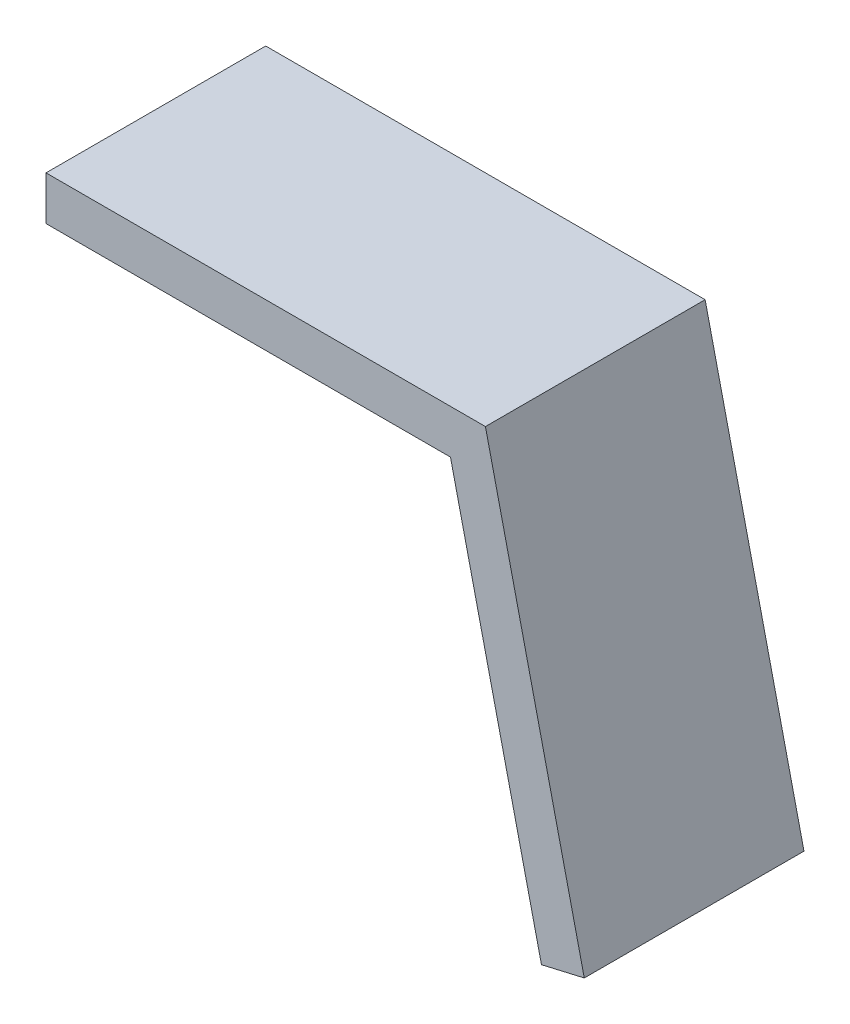
ISO-10303-21;
HEADER;
FILE_DESCRIPTION(('STEP AP214'),'2;1');
FILE_NAME('part.step','',(''),(''),'','','');
FILE_SCHEMA(('AUTOMOTIVE_DESIGN { 1 0 10303 214 1 1 1 1 }'));
ENDSEC;
DATA;
#1=APPLICATION_CONTEXT('core data for automotive mechanical design processes');
#2=APPLICATION_PROTOCOL_DEFINITION('international standard','automotive_design',2000,#1);
#3=PRODUCT_CONTEXT('',#1,'mechanical');
#4=PRODUCT('Part','Part','',(#3));
#5=PRODUCT_RELATED_PRODUCT_CATEGORY('part','',(#4));
#6=PRODUCT_DEFINITION_FORMATION('','',#4);
#7=PRODUCT_DEFINITION_CONTEXT('part definition',#1,'design');
#8=PRODUCT_DEFINITION('design','',#6,#7);
#9=PRODUCT_DEFINITION_SHAPE('','',#8);
#10=(LENGTH_UNIT() NAMED_UNIT(*) SI_UNIT(.MILLI.,.METRE.));
#11=(NAMED_UNIT(*) PLANE_ANGLE_UNIT() SI_UNIT($,.RADIAN.));
#12=(NAMED_UNIT(*) SI_UNIT($,.STERADIAN.) SOLID_ANGLE_UNIT());
#13=UNCERTAINTY_MEASURE_WITH_UNIT(LENGTH_MEASURE(1.E-05),#10,'distance_accuracy_value','');
#14=(GEOMETRIC_REPRESENTATION_CONTEXT(3) GLOBAL_UNCERTAINTY_ASSIGNED_CONTEXT((#13)) GLOBAL_UNIT_ASSIGNED_CONTEXT((#10,
#11,#12)) REPRESENTATION_CONTEXT('',''));
#15=CARTESIAN_POINT('',(0.,0.,0.));
#16=DIRECTION('',(0.,0.,1.));
#17=DIRECTION('',(1.,0.,0.));
#18=AXIS2_PLACEMENT_3D('',#15,#16,#17);
#19=CARTESIAN_POINT('',(100.,0.,50.));
#20=DIRECTION('',(-0.974370064785234,-0.224951054343869,0.));
#21=DIRECTION('',(0.224951054343869,-0.974370064785234,0.));
#22=AXIS2_PLACEMENT_3D('',#19,#20,#21);
#23=PLANE('',#22);
#24=DIRECTION('',(-0.224951054343869,0.974370064785234,0.));
#25=VECTOR('',#24,1.);
#26=CARTESIAN_POINT('',(100.,0.,0.));
#27=LINE('',#26,#25);
#28=CARTESIAN_POINT('',(122.495105434387,-97.4370064785234,0.));
#29=VERTEX_POINT('',#28);
#30=CARTESIAN_POINT('',(100.,0.,0.));
#31=VERTEX_POINT('',#30);
#32=EDGE_CURVE('E116',#29,#31,#27,.T.);
#33=ORIENTED_EDGE('',*,*,#32,.T.);
#34=DIRECTION('',(0.,0.,-1.));
#35=VECTOR('',#34,1.);
#36=CARTESIAN_POINT('',(100.,0.,50.));
#37=LINE('',#36,#35);
#38=CARTESIAN_POINT('',(100.,0.,50.));
#39=VERTEX_POINT('',#38);
#40=EDGE_CURVE('E11',#39,#31,#37,.T.);
#41=ORIENTED_EDGE('',*,*,#40,.F.);
#42=DIRECTION('',(-0.224951054343869,0.974370064785234,0.));
#43=VECTOR('',#42,1.);
#44=CARTESIAN_POINT('',(100.,0.,50.));
#45=LINE('',#44,#43);
#46=CARTESIAN_POINT('',(122.495105434387,-97.4370064785234,50.));
#47=VERTEX_POINT('',#46);
#48=EDGE_CURVE('E126',#47,#39,#45,.T.);
#49=ORIENTED_EDGE('',*,*,#48,.F.);
#50=DIRECTION('',(0.,0.,-1.));
#51=VECTOR('',#50,1.);
#52=CARTESIAN_POINT('',(122.495105434387,-97.4370064785234,50.));
#53=LINE('',#52,#51);
#54=EDGE_CURVE('E112',#47,#29,#53,.T.);
#55=ORIENTED_EDGE('',*,*,#54,.T.);
#56=EDGE_LOOP('',(#33,#41,#49,#55));
#57=FACE_BOUND('',#56,.T.);
#58=ADVANCED_FACE('F32',(#57),#23,.F.);
#59=CARTESIAN_POINT('',(100.,0.,50.));
#60=DIRECTION('',(0.,-1.,0.));
#61=DIRECTION('',(1.,0.,0.));
#62=AXIS2_PLACEMENT_3D('',#59,#60,#61);
#63=PLANE('',#62);
#64=DIRECTION('',(-1.,0.,0.));
#65=VECTOR('',#64,1.);
#66=CARTESIAN_POINT('',(100.,0.,0.));
#67=LINE('',#66,#65);
#68=CARTESIAN_POINT('',(0.,0.,0.));
#69=VERTEX_POINT('',#68);
#70=EDGE_CURVE('E119',#31,#69,#67,.T.);
#71=ORIENTED_EDGE('',*,*,#70,.T.);
#72=DIRECTION('',(0.,0.,-1.));
#73=VECTOR('',#72,1.);
#74=CARTESIAN_POINT('',(0.,0.,50.));
#75=LINE('',#74,#73);
#76=CARTESIAN_POINT('',(0.,0.,50.));
#77=VERTEX_POINT('',#76);
#78=EDGE_CURVE('E40',#77,#69,#75,.T.);
#79=ORIENTED_EDGE('',*,*,#78,.F.);
#80=DIRECTION('',(-1.,0.,0.));
#81=VECTOR('',#80,1.);
#82=CARTESIAN_POINT('',(100.,0.,50.));
#83=LINE('',#82,#81);
#84=EDGE_CURVE('E85',#39,#77,#83,.T.);
#85=ORIENTED_EDGE('',*,*,#84,.F.);
#86=ORIENTED_EDGE('',*,*,#40,.T.);
#87=EDGE_LOOP('',(#71,#79,#85,#86));
#88=FACE_BOUND('',#87,.T.);
#89=ADVANCED_FACE('F150',(#88),#63,.F.);
#90=CARTESIAN_POINT('',(0.,0.,50.));
#91=DIRECTION('',(1.,0.,0.));
#92=DIRECTION('',(0.,1.,0.));
#93=AXIS2_PLACEMENT_3D('',#90,#91,#92);
#94=PLANE('',#93);
#95=DIRECTION('',(0.,-1.,0.));
#96=VECTOR('',#95,1.);
#97=CARTESIAN_POINT('',(0.,0.,0.));
#98=LINE('',#97,#96);
#99=CARTESIAN_POINT('',(0.,-10.,0.));
#100=VERTEX_POINT('',#99);
#101=EDGE_CURVE('E121',#69,#100,#98,.T.);
#102=ORIENTED_EDGE('',*,*,#101,.T.);
#103=DIRECTION('',(0.,0.,-1.));
#104=VECTOR('',#103,1.);
#105=CARTESIAN_POINT('',(0.,-10.,50.));
#106=LINE('',#105,#104);
#107=CARTESIAN_POINT('',(0.,-10.,50.));
#108=VERTEX_POINT('',#107);
#109=EDGE_CURVE('E107',#108,#100,#106,.T.);
#110=ORIENTED_EDGE('',*,*,#109,.F.);
#111=DIRECTION('',(0.,-1.,0.));
#112=VECTOR('',#111,1.);
#113=CARTESIAN_POINT('',(0.,0.,50.));
#114=LINE('',#113,#112);
#115=EDGE_CURVE('E98',#77,#108,#114,.T.);
#116=ORIENTED_EDGE('',*,*,#115,.F.);
#117=ORIENTED_EDGE('',*,*,#78,.T.);
#118=EDGE_LOOP('',(#102,#110,#116,#117));
#119=FACE_BOUND('',#118,.T.);
#120=ADVANCED_FACE('F132',(#119),#94,.F.);
#121=CARTESIAN_POINT('',(92.0456408333218,-9.99999999999999,50.));
#122=DIRECTION('',(0.,1.,0.));
#123=DIRECTION('',(-1.,0.,0.));
#124=AXIS2_PLACEMENT_3D('',#121,#122,#123);
#125=PLANE('',#124);
#126=DIRECTION('',(1.,0.,0.));
#127=VECTOR('',#126,1.);
#128=CARTESIAN_POINT('',(92.0456408333218,-9.99999999999999,0.));
#129=LINE('',#128,#127);
#130=CARTESIAN_POINT('',(92.0456408333218,-9.99999999999999,0.));
#131=VERTEX_POINT('',#130);
#132=EDGE_CURVE('E106',#100,#131,#129,.T.);
#133=ORIENTED_EDGE('',*,*,#132,.T.);
#134=DIRECTION('',(0.,0.,-1.));
#135=VECTOR('',#134,1.);
#136=CARTESIAN_POINT('',(92.0456408333218,-9.99999999999999,50.));
#137=LINE('',#136,#135);
#138=CARTESIAN_POINT('',(92.0456408333218,-9.99999999999999,50.));
#139=VERTEX_POINT('',#138);
#140=EDGE_CURVE('E103',#139,#131,#137,.T.);
#141=ORIENTED_EDGE('',*,*,#140,.F.);
#142=DIRECTION('',(1.,0.,0.));
#143=VECTOR('',#142,1.);
#144=CARTESIAN_POINT('',(92.0456408333218,-9.99999999999999,50.));
#145=LINE('',#144,#143);
#146=EDGE_CURVE('E92',#108,#139,#145,.T.);
#147=ORIENTED_EDGE('',*,*,#146,.F.);
#148=ORIENTED_EDGE('',*,*,#109,.T.);
#149=EDGE_LOOP('',(#133,#141,#147,#148));
#150=FACE_BOUND('',#149,.T.);
#151=ADVANCED_FACE('F104',(#150),#125,.F.);
#152=CARTESIAN_POINT('',(112.751404786535,-99.6865170219621,50.));
#153=DIRECTION('',(0.974370064785234,0.224951054343869,0.));
#154=DIRECTION('',(-0.224951054343869,0.974370064785234,0.));
#155=AXIS2_PLACEMENT_3D('',#152,#153,#154);
#156=PLANE('',#155);
#157=DIRECTION('',(0.224951054343869,-0.974370064785234,0.));
#158=VECTOR('',#157,1.);
#159=CARTESIAN_POINT('',(112.751404786535,-99.6865170219621,0.));
#160=LINE('',#159,#158);
#161=CARTESIAN_POINT('',(112.751404786535,-99.6865170219621,0.));
#162=VERTEX_POINT('',#161);
#163=EDGE_CURVE('E71',#131,#162,#160,.T.);
#164=ORIENTED_EDGE('',*,*,#163,.T.);
#165=DIRECTION('',(0.,0.,-1.));
#166=VECTOR('',#165,1.);
#167=CARTESIAN_POINT('',(112.751404786535,-99.6865170219621,50.));
#168=LINE('',#167,#166);
#169=CARTESIAN_POINT('',(112.751404786535,-99.6865170219621,50.));
#170=VERTEX_POINT('',#169);
#171=EDGE_CURVE('E108',#170,#162,#168,.T.);
#172=ORIENTED_EDGE('',*,*,#171,.F.);
#173=DIRECTION('',(0.224951054343869,-0.974370064785234,0.));
#174=VECTOR('',#173,1.);
#175=CARTESIAN_POINT('',(112.751404786535,-99.6865170219621,50.));
#176=LINE('',#175,#174);
#177=EDGE_CURVE('E96',#139,#170,#176,.T.);
#178=ORIENTED_EDGE('',*,*,#177,.F.);
#179=ORIENTED_EDGE('',*,*,#140,.T.);
#180=EDGE_LOOP('',(#164,#172,#178,#179));
#181=FACE_BOUND('',#180,.T.);
#182=ADVANCED_FACE('F110',(#181),#156,.F.);
#183=CARTESIAN_POINT('',(122.495105434387,-97.4370064785234,50.));
#184=DIRECTION('',(-0.224951054343869,0.974370064785234,0.));
#185=DIRECTION('',(-0.974370064785234,-0.224951054343869,0.));
#186=AXIS2_PLACEMENT_3D('',#183,#184,#185);
#187=PLANE('',#186);
#188=DIRECTION('',(0.974370064785234,0.224951054343869,0.));
#189=VECTOR('',#188,1.);
#190=CARTESIAN_POINT('',(122.495105434387,-97.4370064785234,0.));
#191=LINE('',#190,#189);
#192=EDGE_CURVE('E77',#162,#29,#191,.T.);
#193=ORIENTED_EDGE('',*,*,#192,.T.);
#194=ORIENTED_EDGE('',*,*,#54,.F.);
#195=DIRECTION('',(0.974370064785234,0.224951054343869,0.));
#196=VECTOR('',#195,1.);
#197=CARTESIAN_POINT('',(122.495105434387,-97.4370064785234,50.));
#198=LINE('',#197,#196);
#199=EDGE_CURVE('E48',#170,#47,#198,.T.);
#200=ORIENTED_EDGE('',*,*,#199,.F.);
#201=ORIENTED_EDGE('',*,*,#171,.T.);
#202=EDGE_LOOP('',(#193,#194,#200,#201));
#203=FACE_BOUND('',#202,.T.);
#204=ADVANCED_FACE('F139',(#203),#187,.F.);
#205=CARTESIAN_POINT('',(0.,0.,50.));
#206=DIRECTION('',(0.,0.,-1.));
#207=DIRECTION('',(-1.,0.,0.));
#208=AXIS2_PLACEMENT_3D('',#205,#206,#207);
#209=PLANE('',#208);
#210=ORIENTED_EDGE('',*,*,#48,.T.);
#211=ORIENTED_EDGE('',*,*,#84,.T.);
#212=ORIENTED_EDGE('',*,*,#115,.T.);
#213=ORIENTED_EDGE('',*,*,#146,.T.);
#214=ORIENTED_EDGE('',*,*,#177,.T.);
#215=ORIENTED_EDGE('',*,*,#199,.T.);
#216=EDGE_LOOP('',(#210,#211,#212,#213,#214,#215));
#217=FACE_BOUND('',#216,.T.);
#218=ADVANCED_FACE('F94',(#217),#209,.F.);
#219=CARTESIAN_POINT('',(0.,0.,0.));
#220=DIRECTION('',(0.,0.,-1.));
#221=DIRECTION('',(-1.,0.,0.));
#222=AXIS2_PLACEMENT_3D('',#219,#220,#221);
#223=PLANE('',#222);
#224=ORIENTED_EDGE('',*,*,#32,.F.);
#225=ORIENTED_EDGE('',*,*,#192,.F.);
#226=ORIENTED_EDGE('',*,*,#163,.F.);
#227=ORIENTED_EDGE('',*,*,#132,.F.);
#228=ORIENTED_EDGE('',*,*,#101,.F.);
#229=ORIENTED_EDGE('',*,*,#70,.F.);
#230=EDGE_LOOP('',(#224,#225,#226,#227,#228,#229));
#231=FACE_BOUND('',#230,.T.);
#232=ADVANCED_FACE('F135',(#231),#223,.T.);
#233=CLOSED_SHELL('',(#58,#89,#120,#151,#182,#204,#218,#232));
#234=MANIFOLD_SOLID_BREP('B2',#233);
#235=ADVANCED_BREP_SHAPE_REPRESENTATION('',(#18,#234),#14);
#236=SHAPE_DEFINITION_REPRESENTATION(#9,#235);
ENDSEC;
END-ISO-10303-21;
